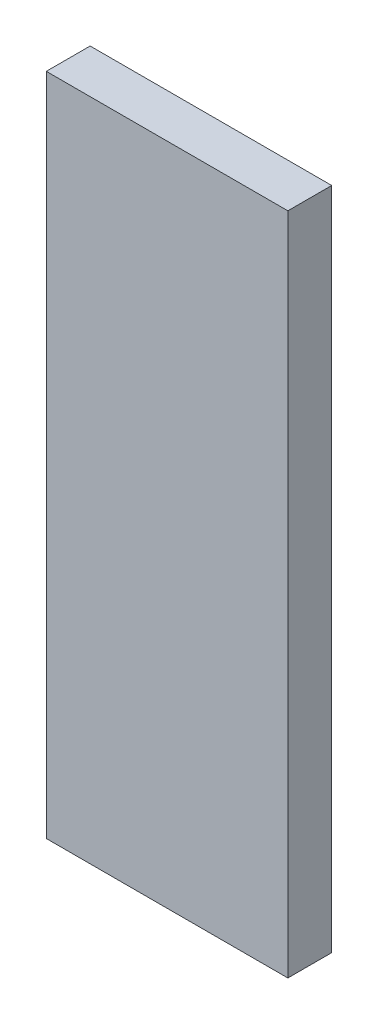
ISO-10303-21;
HEADER;
FILE_DESCRIPTION(('STEP AP214'),'2;1');
FILE_NAME('part.step','',(''),(''),'','','');
FILE_SCHEMA(('AUTOMOTIVE_DESIGN { 1 0 10303 214 1 1 1 1 }'));
ENDSEC;
DATA;
#1=APPLICATION_CONTEXT('core data for automotive mechanical design processes');
#2=APPLICATION_PROTOCOL_DEFINITION('international standard','automotive_design',2000,#1);
#3=PRODUCT_CONTEXT('',#1,'mechanical');
#4=PRODUCT('Part','Part','',(#3));
#5=PRODUCT_RELATED_PRODUCT_CATEGORY('part','',(#4));
#6=PRODUCT_DEFINITION_FORMATION('','',#4);
#7=PRODUCT_DEFINITION_CONTEXT('part definition',#1,'design');
#8=PRODUCT_DEFINITION('design','',#6,#7);
#9=PRODUCT_DEFINITION_SHAPE('','',#8);
#10=(LENGTH_UNIT() NAMED_UNIT(*) SI_UNIT(.MILLI.,.METRE.));
#11=(NAMED_UNIT(*) PLANE_ANGLE_UNIT() SI_UNIT($,.RADIAN.));
#12=(NAMED_UNIT(*) SI_UNIT($,.STERADIAN.) SOLID_ANGLE_UNIT());
#13=UNCERTAINTY_MEASURE_WITH_UNIT(LENGTH_MEASURE(1.E-05),#10,'distance_accuracy_value','');
#14=(GEOMETRIC_REPRESENTATION_CONTEXT(3) GLOBAL_UNCERTAINTY_ASSIGNED_CONTEXT((#13)) GLOBAL_UNIT_ASSIGNED_CONTEXT((#10,
#11,#12)) REPRESENTATION_CONTEXT('',''));
#15=CARTESIAN_POINT('',(0.,0.,0.));
#16=DIRECTION('',(0.,0.,1.));
#17=DIRECTION('',(1.,0.,0.));
#18=AXIS2_PLACEMENT_3D('',#15,#16,#17);
#19=CARTESIAN_POINT('',(0.205824988466813,-0.168544007732833,0.));
#20=DIRECTION('',(-1.,0.,0.));
#21=DIRECTION('',(0.,-1.,0.));
#22=AXIS2_PLACEMENT_3D('',#19,#20,#21);
#23=PLANE('',#22);
#24=DIRECTION('',(0.,-1.,0.));
#25=VECTOR('',#24,1.);
#26=CARTESIAN_POINT('',(0.205824988466813,-0.168544007732833,0.));
#27=LINE('',#26,#25);
#28=CARTESIAN_POINT('',(0.205824988466813,-0.168544007732833,0.));
#29=VERTEX_POINT('',#28);
#30=CARTESIAN_POINT('',(0.205824988466813,-0.213990771146421,0.));
#31=VERTEX_POINT('',#30);
#32=EDGE_CURVE('E11',#29,#31,#27,.T.);
#33=ORIENTED_EDGE('',*,*,#32,.T.);
#34=DIRECTION('',(0.,0.,1.));
#35=VECTOR('',#34,1.);
#36=CARTESIAN_POINT('',(0.205824988466813,-0.213990771146421,0.));
#37=LINE('',#36,#35);
#38=CARTESIAN_POINT('',(0.205824988466813,-0.213990771146421,0.003));
#39=VERTEX_POINT('',#38);
#40=EDGE_CURVE('E24',#31,#39,#37,.T.);
#41=ORIENTED_EDGE('',*,*,#40,.T.);
#42=DIRECTION('',(0.,-1.,0.));
#43=VECTOR('',#42,1.);
#44=CARTESIAN_POINT('',(0.205824988466813,-0.168544007732833,0.003));
#45=LINE('',#44,#43);
#46=CARTESIAN_POINT('',(0.205824988466813,-0.168544007732833,0.003));
#47=VERTEX_POINT('',#46);
#48=EDGE_CURVE('E75',#47,#39,#45,.T.);
#49=ORIENTED_EDGE('',*,*,#48,.F.);
#50=DIRECTION('',(0.,0.,1.));
#51=VECTOR('',#50,1.);
#52=CARTESIAN_POINT('',(0.205824988466813,-0.168544007732833,0.));
#53=LINE('',#52,#51);
#54=EDGE_CURVE('E86',#29,#47,#53,.T.);
#55=ORIENTED_EDGE('',*,*,#54,.F.);
#56=EDGE_LOOP('',(#33,#41,#49,#55));
#57=FACE_BOUND('',#56,.T.);
#58=ADVANCED_FACE('F17',(#57),#23,.T.);
#59=CARTESIAN_POINT('',(0.222348251639588,-0.168544007732833,0.));
#60=DIRECTION('',(0.,1.,0.));
#61=DIRECTION('',(-1.,0.,0.));
#62=AXIS2_PLACEMENT_3D('',#59,#60,#61);
#63=PLANE('',#62);
#64=DIRECTION('',(-1.,0.,0.));
#65=VECTOR('',#64,1.);
#66=CARTESIAN_POINT('',(0.222348251639588,-0.168544007732833,0.));
#67=LINE('',#66,#65);
#68=CARTESIAN_POINT('',(0.222348251639588,-0.168544007732833,0.));
#69=VERTEX_POINT('',#68);
#70=EDGE_CURVE('E83',#69,#29,#67,.T.);
#71=ORIENTED_EDGE('',*,*,#70,.T.);
#72=ORIENTED_EDGE('',*,*,#54,.T.);
#73=DIRECTION('',(-1.,0.,0.));
#74=VECTOR('',#73,1.);
#75=CARTESIAN_POINT('',(0.222348251639588,-0.168544007732833,0.003));
#76=LINE('',#75,#74);
#77=CARTESIAN_POINT('',(0.222348251639588,-0.168544007732833,0.003));
#78=VERTEX_POINT('',#77);
#79=EDGE_CURVE('E81',#78,#47,#76,.T.);
#80=ORIENTED_EDGE('',*,*,#79,.F.);
#81=DIRECTION('',(0.,0.,1.));
#82=VECTOR('',#81,1.);
#83=CARTESIAN_POINT('',(0.222348251639588,-0.168544007732833,0.));
#84=LINE('',#83,#82);
#85=EDGE_CURVE('E61',#69,#78,#84,.T.);
#86=ORIENTED_EDGE('',*,*,#85,.F.);
#87=EDGE_LOOP('',(#71,#72,#80,#86));
#88=FACE_BOUND('',#87,.T.);
#89=ADVANCED_FACE('F91',(#88),#63,.T.);
#90=CARTESIAN_POINT('',(0.222348251639588,-0.213990771146421,0.));
#91=DIRECTION('',(1.,0.,0.));
#92=DIRECTION('',(0.,1.,0.));
#93=AXIS2_PLACEMENT_3D('',#90,#91,#92);
#94=PLANE('',#93);
#95=DIRECTION('',(0.,1.,0.));
#96=VECTOR('',#95,1.);
#97=CARTESIAN_POINT('',(0.222348251639588,-0.213990771146421,0.));
#98=LINE('',#97,#96);
#99=CARTESIAN_POINT('',(0.222348251639588,-0.213990771146421,0.));
#100=VERTEX_POINT('',#99);
#101=EDGE_CURVE('E65',#100,#69,#98,.T.);
#102=ORIENTED_EDGE('',*,*,#101,.T.);
#103=ORIENTED_EDGE('',*,*,#85,.T.);
#104=DIRECTION('',(0.,1.,0.));
#105=VECTOR('',#104,1.);
#106=CARTESIAN_POINT('',(0.222348251639588,-0.213990771146421,0.003));
#107=LINE('',#106,#105);
#108=CARTESIAN_POINT('',(0.222348251639588,-0.213990771146421,0.003));
#109=VERTEX_POINT('',#108);
#110=EDGE_CURVE('E54',#109,#78,#107,.T.);
#111=ORIENTED_EDGE('',*,*,#110,.F.);
#112=DIRECTION('',(0.,0.,1.));
#113=VECTOR('',#112,1.);
#114=CARTESIAN_POINT('',(0.222348251639588,-0.213990771146421,0.));
#115=LINE('',#114,#113);
#116=EDGE_CURVE('E58',#100,#109,#115,.T.);
#117=ORIENTED_EDGE('',*,*,#116,.F.);
#118=EDGE_LOOP('',(#102,#103,#111,#117));
#119=FACE_BOUND('',#118,.T.);
#120=ADVANCED_FACE('F57',(#119),#94,.T.);
#121=CARTESIAN_POINT('',(0.205824988466813,-0.213990771146421,0.));
#122=DIRECTION('',(0.,-1.,0.));
#123=DIRECTION('',(1.,0.,0.));
#124=AXIS2_PLACEMENT_3D('',#121,#122,#123);
#125=PLANE('',#124);
#126=DIRECTION('',(1.,0.,0.));
#127=VECTOR('',#126,1.);
#128=CARTESIAN_POINT('',(0.205824988466813,-0.213990771146421,0.));
#129=LINE('',#128,#127);
#130=EDGE_CURVE('E71',#31,#100,#129,.T.);
#131=ORIENTED_EDGE('',*,*,#130,.T.);
#132=ORIENTED_EDGE('',*,*,#116,.T.);
#133=DIRECTION('',(1.,0.,0.));
#134=VECTOR('',#133,1.);
#135=CARTESIAN_POINT('',(0.205824988466813,-0.213990771146421,0.003));
#136=LINE('',#135,#134);
#137=EDGE_CURVE('E70',#39,#109,#136,.T.);
#138=ORIENTED_EDGE('',*,*,#137,.F.);
#139=ORIENTED_EDGE('',*,*,#40,.F.);
#140=EDGE_LOOP('',(#131,#132,#138,#139));
#141=FACE_BOUND('',#140,.T.);
#142=ADVANCED_FACE('F69',(#141),#125,.T.);
#143=CARTESIAN_POINT('',(0.2140866200532,-0.191267389439627,0.003));
#144=DIRECTION('',(0.,0.,1.));
#145=DIRECTION('',(1.,0.,0.));
#146=AXIS2_PLACEMENT_3D('',#143,#144,#145);
#147=PLANE('',#146);
#148=ORIENTED_EDGE('',*,*,#137,.T.);
#149=ORIENTED_EDGE('',*,*,#110,.T.);
#150=ORIENTED_EDGE('',*,*,#79,.T.);
#151=ORIENTED_EDGE('',*,*,#48,.T.);
#152=EDGE_LOOP('',(#148,#149,#150,#151));
#153=FACE_BOUND('',#152,.T.);
#154=ADVANCED_FACE('F74',(#153),#147,.T.);
#155=CARTESIAN_POINT('',(0.2140866200532,-0.191267389439627,0.));
#156=DIRECTION('',(0.,0.,1.));
#157=DIRECTION('',(1.,0.,0.));
#158=AXIS2_PLACEMENT_3D('',#155,#156,#157);
#159=PLANE('',#158);
#160=ORIENTED_EDGE('',*,*,#130,.F.);
#161=ORIENTED_EDGE('',*,*,#32,.F.);
#162=ORIENTED_EDGE('',*,*,#70,.F.);
#163=ORIENTED_EDGE('',*,*,#101,.F.);
#164=EDGE_LOOP('',(#160,#161,#162,#163));
#165=FACE_BOUND('',#164,.T.);
#166=ADVANCED_FACE('F89',(#165),#159,.F.);
#167=CLOSED_SHELL('',(#58,#89,#120,#142,#154,#166));
#168=MANIFOLD_SOLID_BREP('B1',#167);
#169=ADVANCED_BREP_SHAPE_REPRESENTATION('',(#18,#168),#14);
#170=SHAPE_DEFINITION_REPRESENTATION(#9,#169);
ENDSEC;
END-ISO-10303-21;
